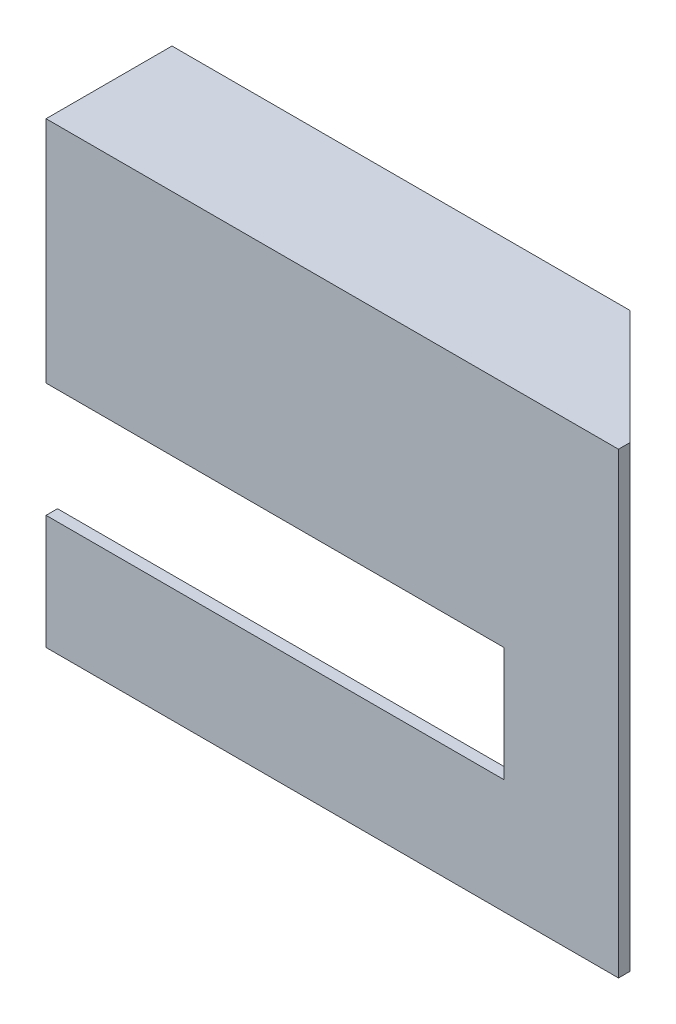
ISO-10303-21;
HEADER;
FILE_DESCRIPTION(('STEP AP214'),'2;1');
FILE_NAME('part.step','',(''),(''),'','','');
FILE_SCHEMA(('AUTOMOTIVE_DESIGN { 1 0 10303 214 1 1 1 1 }'));
ENDSEC;
DATA;
#1=APPLICATION_CONTEXT('core data for automotive mechanical design processes');
#2=APPLICATION_PROTOCOL_DEFINITION('international standard','automotive_design',2000,#1);
#3=PRODUCT_CONTEXT('',#1,'mechanical');
#4=PRODUCT('Part','Part','',(#3));
#5=PRODUCT_RELATED_PRODUCT_CATEGORY('part','',(#4));
#6=PRODUCT_DEFINITION_FORMATION('','',#4);
#7=PRODUCT_DEFINITION_CONTEXT('part definition',#1,'design');
#8=PRODUCT_DEFINITION('design','',#6,#7);
#9=PRODUCT_DEFINITION_SHAPE('','',#8);
#10=(LENGTH_UNIT() NAMED_UNIT(*) SI_UNIT(.MILLI.,.METRE.));
#11=(NAMED_UNIT(*) PLANE_ANGLE_UNIT() SI_UNIT($,.RADIAN.));
#12=(NAMED_UNIT(*) SI_UNIT($,.STERADIAN.) SOLID_ANGLE_UNIT());
#13=UNCERTAINTY_MEASURE_WITH_UNIT(LENGTH_MEASURE(1.E-05),#10,'distance_accuracy_value','');
#14=(GEOMETRIC_REPRESENTATION_CONTEXT(3) GLOBAL_UNCERTAINTY_ASSIGNED_CONTEXT((#13)) GLOBAL_UNIT_ASSIGNED_CONTEXT((#10,
#11,#12)) REPRESENTATION_CONTEXT('',''));
#15=CARTESIAN_POINT('',(0.,0.,0.));
#16=DIRECTION('',(0.,0.,1.));
#17=DIRECTION('',(1.,0.,0.));
#18=AXIS2_PLACEMENT_3D('',#15,#16,#17);
#19=CARTESIAN_POINT('',(0.,0.,0.));
#20=DIRECTION('',(0.,0.,1.));
#21=DIRECTION('',(1.,0.,0.));
#22=AXIS2_PLACEMENT_3D('',#19,#20,#21);
#23=PLANE('',#22);
#24=DIRECTION('',(-1.,0.,0.));
#25=VECTOR('',#24,1.);
#26=CARTESIAN_POINT('',(-20.1129872057257,10.9548051177097,0.));
#27=LINE('',#26,#25);
#28=CARTESIAN_POINT('',(29.8870127942743,10.9548051177097,0.));
#29=VERTEX_POINT('',#28);
#30=CARTESIAN_POINT('',(-20.1129872057257,10.9548051177097,0.));
#31=VERTEX_POINT('',#30);
#32=EDGE_CURVE('E122',#29,#31,#27,.T.);
#33=ORIENTED_EDGE('',*,*,#32,.F.);
#34=DIRECTION('',(0.,1.,0.));
#35=VECTOR('',#34,1.);
#36=CARTESIAN_POINT('',(29.8870127942743,11.9548051177097,0.));
#37=LINE('',#36,#35);
#38=CARTESIAN_POINT('',(29.8870127942743,-28.0451948822903,0.));
#39=VERTEX_POINT('',#38);
#40=EDGE_CURVE('E130',#39,#29,#37,.T.);
#41=ORIENTED_EDGE('',*,*,#40,.F.);
#42=DIRECTION('',(1.,0.,0.));
#43=VECTOR('',#42,1.);
#44=CARTESIAN_POINT('',(-20.1129872057257,-28.0451948822903,0.));
#45=LINE('',#44,#43);
#46=CARTESIAN_POINT('',(-20.1129872057257,-28.0451948822903,0.));
#47=VERTEX_POINT('',#46);
#48=EDGE_CURVE('E230',#47,#39,#45,.T.);
#49=ORIENTED_EDGE('',*,*,#48,.F.);
#50=DIRECTION('',(0.,-1.,0.));
#51=VECTOR('',#50,1.);
#52=CARTESIAN_POINT('',(-20.1129872057257,-18.0451948822903,0.));
#53=LINE('',#52,#51);
#54=CARTESIAN_POINT('',(-20.1129872057257,-18.0451948822903,0.));
#55=VERTEX_POINT('',#54);
#56=EDGE_CURVE('E228',#55,#47,#53,.T.);
#57=ORIENTED_EDGE('',*,*,#56,.F.);
#58=DIRECTION('',(-1.,0.,0.));
#59=VECTOR('',#58,1.);
#60=CARTESIAN_POINT('',(19.8870127942743,-18.0451948822903,0.));
#61=LINE('',#60,#59);
#62=CARTESIAN_POINT('',(19.8870127942743,-18.0451948822903,0.));
#63=VERTEX_POINT('',#62);
#64=EDGE_CURVE('E226',#63,#55,#61,.T.);
#65=ORIENTED_EDGE('',*,*,#64,.F.);
#66=DIRECTION('',(0.,-1.,0.));
#67=VECTOR('',#66,1.);
#68=CARTESIAN_POINT('',(19.8870127942743,-8.04519488229028,0.));
#69=LINE('',#68,#67);
#70=CARTESIAN_POINT('',(19.8870127942743,-8.04519488229028,0.));
#71=VERTEX_POINT('',#70);
#72=EDGE_CURVE('E224',#71,#63,#69,.T.);
#73=ORIENTED_EDGE('',*,*,#72,.F.);
#74=DIRECTION('',(1.,0.,0.));
#75=VECTOR('',#74,1.);
#76=CARTESIAN_POINT('',(-20.1129872057257,-8.04519488229028,0.));
#77=LINE('',#76,#75);
#78=CARTESIAN_POINT('',(-20.1129872057257,-8.04519488229028,0.));
#79=VERTEX_POINT('',#78);
#80=EDGE_CURVE('E222',#79,#71,#77,.T.);
#81=ORIENTED_EDGE('',*,*,#80,.F.);
#82=DIRECTION('',(0.,-1.,0.));
#83=VECTOR('',#82,1.);
#84=CARTESIAN_POINT('',(-20.1129872057257,11.9548051177097,0.));
#85=LINE('',#84,#83);
#86=EDGE_CURVE('E146',#31,#79,#85,.T.);
#87=ORIENTED_EDGE('',*,*,#86,.F.);
#88=EDGE_LOOP('',(#33,#41,#49,#57,#65,#73,#81,#87));
#89=FACE_BOUND('',#88,.T.);
#90=ADVANCED_FACE('F33',(#89),#23,.F.);
#91=CARTESIAN_POINT('',(29.8870127942743,11.9548051177097,1.));
#92=DIRECTION('',(-1.,0.,0.));
#93=DIRECTION('',(0.,-1.,0.));
#94=AXIS2_PLACEMENT_3D('',#91,#92,#93);
#95=PLANE('',#94);
#96=ORIENTED_EDGE('',*,*,#40,.T.);
#97=DIRECTION('',(0.,1.,0.));
#98=VECTOR('',#97,1.);
#99=CARTESIAN_POINT('',(29.8870127942743,11.9548051177097,0.));
#100=LINE('',#99,#98);
#101=CARTESIAN_POINT('',(29.8870127942743,11.9548051177097,0.));
#102=VERTEX_POINT('',#101);
#103=EDGE_CURVE('E41',#29,#102,#100,.T.);
#104=ORIENTED_EDGE('',*,*,#103,.T.);
#105=DIRECTION('',(0.,0.,-1.));
#106=VECTOR('',#105,1.);
#107=CARTESIAN_POINT('',(29.8870127942743,11.9548051177097,1.));
#108=LINE('',#107,#106);
#109=CARTESIAN_POINT('',(29.8870127942743,11.9548051177097,1.));
#110=VERTEX_POINT('',#109);
#111=EDGE_CURVE('E154',#110,#102,#108,.T.);
#112=ORIENTED_EDGE('',*,*,#111,.F.);
#113=DIRECTION('',(0.,1.,0.));
#114=VECTOR('',#113,1.);
#115=CARTESIAN_POINT('',(29.8870127942743,-17.7643136671579,1.));
#116=LINE('',#115,#114);
#117=CARTESIAN_POINT('',(29.8870127942743,-28.0451948822903,1.));
#118=VERTEX_POINT('',#117);
#119=EDGE_CURVE('E142',#118,#110,#116,.T.);
#120=ORIENTED_EDGE('',*,*,#119,.F.);
#121=DIRECTION('',(0.,0.,-1.));
#122=VECTOR('',#121,1.);
#123=CARTESIAN_POINT('',(29.8870127942743,-28.0451948822903,1.));
#124=LINE('',#123,#122);
#125=EDGE_CURVE('E168',#118,#39,#124,.T.);
#126=ORIENTED_EDGE('',*,*,#125,.T.);
#127=EDGE_LOOP('',(#96,#104,#112,#120,#126));
#128=FACE_BOUND('',#127,.T.);
#129=ADVANCED_FACE('F165',(#128),#95,.F.);
#130=CARTESIAN_POINT('',(-20.1129872057257,11.9548051177097,1.));
#131=DIRECTION('',(0.,-1.,0.));
#132=DIRECTION('',(0.,0.,-1.));
#133=AXIS2_PLACEMENT_3D('',#130,#131,#132);
#134=PLANE('',#133);
#135=ORIENTED_EDGE('',*,*,#111,.T.);
#136=DIRECTION('',(0.707106781186546,0.,0.707106781186549));
#137=VECTOR('',#136,1.);
#138=CARTESIAN_POINT('',(19.8870127942743,11.9548051177097,-10.));
#139=LINE('',#138,#137);
#140=CARTESIAN_POINT('',(19.8870127942743,11.9548051177097,-10.));
#141=VERTEX_POINT('',#140);
#142=EDGE_CURVE('E11',#102,#141,#139,.F.);
#143=ORIENTED_EDGE('',*,*,#142,.T.);
#144=DIRECTION('',(1.,0.,0.));
#145=VECTOR('',#144,1.);
#146=CARTESIAN_POINT('',(29.8870127942743,11.9548051177097,-10.));
#147=LINE('',#146,#145);
#148=CARTESIAN_POINT('',(-20.1129872057257,11.9548051177097,-10.));
#149=VERTEX_POINT('',#148);
#150=EDGE_CURVE('E131',#149,#141,#147,.T.);
#151=ORIENTED_EDGE('',*,*,#150,.F.);
#152=DIRECTION('',(0.,0.,-1.));
#153=VECTOR('',#152,1.);
#154=CARTESIAN_POINT('',(-20.1129872057257,11.9548051177097,1.));
#155=LINE('',#154,#153);
#156=CARTESIAN_POINT('',(-20.1129872057257,11.9548051177097,1.));
#157=VERTEX_POINT('',#156);
#158=EDGE_CURVE('E136',#157,#149,#155,.T.);
#159=ORIENTED_EDGE('',*,*,#158,.F.);
#160=DIRECTION('',(-1.,0.,0.));
#161=VECTOR('',#160,1.);
#162=CARTESIAN_POINT('',(-20.1129872057257,11.9548051177097,1.));
#163=LINE('',#162,#161);
#164=EDGE_CURVE('E210',#110,#157,#163,.T.);
#165=ORIENTED_EDGE('',*,*,#164,.F.);
#166=EDGE_LOOP('',(#135,#143,#151,#159,#165));
#167=FACE_BOUND('',#166,.T.);
#168=ADVANCED_FACE('F179',(#167),#134,.F.);
#169=CARTESIAN_POINT('',(-20.1129872057257,11.9548051177097,1.));
#170=DIRECTION('',(1.,0.,0.));
#171=DIRECTION('',(0.,0.,-1.));
#172=AXIS2_PLACEMENT_3D('',#169,#170,#171);
#173=PLANE('',#172);
#174=ORIENTED_EDGE('',*,*,#158,.T.);
#175=DIRECTION('',(0.,1.,0.));
#176=VECTOR('',#175,1.);
#177=CARTESIAN_POINT('',(-20.1129872057257,11.9548051177097,-10.));
#178=LINE('',#177,#176);
#179=CARTESIAN_POINT('',(-20.1129872057257,10.9548051177097,-10.));
#180=VERTEX_POINT('',#179);
#181=EDGE_CURVE('E118',#180,#149,#178,.T.);
#182=ORIENTED_EDGE('',*,*,#181,.F.);
#183=DIRECTION('',(0.,0.,1.));
#184=VECTOR('',#183,1.);
#185=CARTESIAN_POINT('',(-20.1129872057257,10.9548051177097,-10.));
#186=LINE('',#185,#184);
#187=EDGE_CURVE('E126',#180,#31,#186,.T.);
#188=ORIENTED_EDGE('',*,*,#187,.T.);
#189=ORIENTED_EDGE('',*,*,#86,.T.);
#190=DIRECTION('',(0.,0.,-1.));
#191=VECTOR('',#190,1.);
#192=CARTESIAN_POINT('',(-20.1129872057257,-8.04519488229028,1.));
#193=LINE('',#192,#191);
#194=CARTESIAN_POINT('',(-20.1129872057257,-8.04519488229028,1.));
#195=VERTEX_POINT('',#194);
#196=EDGE_CURVE('E212',#195,#79,#193,.T.);
#197=ORIENTED_EDGE('',*,*,#196,.F.);
#198=DIRECTION('',(0.,-1.,0.));
#199=VECTOR('',#198,1.);
#200=CARTESIAN_POINT('',(-20.1129872057257,11.9548051177097,1.));
#201=LINE('',#200,#199);
#202=EDGE_CURVE('E265',#157,#195,#201,.T.);
#203=ORIENTED_EDGE('',*,*,#202,.F.);
#204=EDGE_LOOP('',(#174,#182,#188,#189,#197,#203));
#205=FACE_BOUND('',#204,.T.);
#206=ADVANCED_FACE('F133',(#205),#173,.F.);
#207=CARTESIAN_POINT('',(-20.1129872057257,-8.04519488229028,1.));
#208=DIRECTION('',(0.,1.,0.));
#209=DIRECTION('',(0.,0.,1.));
#210=AXIS2_PLACEMENT_3D('',#207,#208,#209);
#211=PLANE('',#210);
#212=ORIENTED_EDGE('',*,*,#80,.T.);
#213=DIRECTION('',(0.,0.,-1.));
#214=VECTOR('',#213,1.);
#215=CARTESIAN_POINT('',(19.8870127942743,-8.04519488229028,1.));
#216=LINE('',#215,#214);
#217=CARTESIAN_POINT('',(19.8870127942743,-8.04519488229028,1.));
#218=VERTEX_POINT('',#217);
#219=EDGE_CURVE('E242',#218,#71,#216,.T.);
#220=ORIENTED_EDGE('',*,*,#219,.F.);
#221=DIRECTION('',(1.,0.,0.));
#222=VECTOR('',#221,1.);
#223=CARTESIAN_POINT('',(-20.1129872057257,-8.04519488229028,1.));
#224=LINE('',#223,#222);
#225=EDGE_CURVE('E248',#195,#218,#224,.T.);
#226=ORIENTED_EDGE('',*,*,#225,.F.);
#227=ORIENTED_EDGE('',*,*,#196,.T.);
#228=EDGE_LOOP('',(#212,#220,#226,#227));
#229=FACE_BOUND('',#228,.T.);
#230=ADVANCED_FACE('F199',(#229),#211,.F.);
#231=CARTESIAN_POINT('',(19.8870127942743,-8.04519488229028,1.));
#232=DIRECTION('',(1.,0.,0.));
#233=DIRECTION('',(0.,0.,-1.));
#234=AXIS2_PLACEMENT_3D('',#231,#232,#233);
#235=PLANE('',#234);
#236=ORIENTED_EDGE('',*,*,#72,.T.);
#237=DIRECTION('',(0.,0.,-1.));
#238=VECTOR('',#237,1.);
#239=CARTESIAN_POINT('',(19.8870127942743,-18.0451948822903,1.));
#240=LINE('',#239,#238);
#241=CARTESIAN_POINT('',(19.8870127942743,-18.0451948822903,1.));
#242=VERTEX_POINT('',#241);
#243=EDGE_CURVE('E239',#242,#63,#240,.T.);
#244=ORIENTED_EDGE('',*,*,#243,.F.);
#245=DIRECTION('',(0.,-1.,0.));
#246=VECTOR('',#245,1.);
#247=CARTESIAN_POINT('',(19.8870127942743,-8.04519488229028,1.));
#248=LINE('',#247,#246);
#249=EDGE_CURVE('E260',#218,#242,#248,.T.);
#250=ORIENTED_EDGE('',*,*,#249,.F.);
#251=ORIENTED_EDGE('',*,*,#219,.T.);
#252=EDGE_LOOP('',(#236,#244,#250,#251));
#253=FACE_BOUND('',#252,.T.);
#254=ADVANCED_FACE('F195',(#253),#235,.F.);
#255=CARTESIAN_POINT('',(19.8870127942743,-18.0451948822903,1.));
#256=DIRECTION('',(0.,-1.,0.));
#257=DIRECTION('',(1.,0.,0.));
#258=AXIS2_PLACEMENT_3D('',#255,#256,#257);
#259=PLANE('',#258);
#260=ORIENTED_EDGE('',*,*,#64,.T.);
#261=DIRECTION('',(0.,0.,-1.));
#262=VECTOR('',#261,1.);
#263=CARTESIAN_POINT('',(-20.1129872057257,-18.0451948822903,1.));
#264=LINE('',#263,#262);
#265=CARTESIAN_POINT('',(-20.1129872057257,-18.0451948822903,1.));
#266=VERTEX_POINT('',#265);
#267=EDGE_CURVE('E236',#266,#55,#264,.T.);
#268=ORIENTED_EDGE('',*,*,#267,.F.);
#269=DIRECTION('',(-1.,0.,0.));
#270=VECTOR('',#269,1.);
#271=CARTESIAN_POINT('',(19.8870127942743,-18.0451948822903,1.));
#272=LINE('',#271,#270);
#273=EDGE_CURVE('E256',#242,#266,#272,.T.);
#274=ORIENTED_EDGE('',*,*,#273,.F.);
#275=ORIENTED_EDGE('',*,*,#243,.T.);
#276=EDGE_LOOP('',(#260,#268,#274,#275));
#277=FACE_BOUND('',#276,.T.);
#278=ADVANCED_FACE('F191',(#277),#259,.F.);
#279=CARTESIAN_POINT('',(-20.1129872057257,-18.0451948822903,1.));
#280=DIRECTION('',(1.,0.,0.));
#281=DIRECTION('',(0.,0.,-1.));
#282=AXIS2_PLACEMENT_3D('',#279,#280,#281);
#283=PLANE('',#282);
#284=ORIENTED_EDGE('',*,*,#56,.T.);
#285=DIRECTION('',(0.,0.,-1.));
#286=VECTOR('',#285,1.);
#287=CARTESIAN_POINT('',(-20.1129872057257,-28.0451948822903,1.));
#288=LINE('',#287,#286);
#289=CARTESIAN_POINT('',(-20.1129872057257,-28.0451948822903,1.));
#290=VERTEX_POINT('',#289);
#291=EDGE_CURVE('E233',#290,#47,#288,.T.);
#292=ORIENTED_EDGE('',*,*,#291,.F.);
#293=DIRECTION('',(0.,-1.,0.));
#294=VECTOR('',#293,1.);
#295=CARTESIAN_POINT('',(-20.1129872057257,-18.0451948822903,1.));
#296=LINE('',#295,#294);
#297=EDGE_CURVE('E259',#266,#290,#296,.T.);
#298=ORIENTED_EDGE('',*,*,#297,.F.);
#299=ORIENTED_EDGE('',*,*,#267,.T.);
#300=EDGE_LOOP('',(#284,#292,#298,#299));
#301=FACE_BOUND('',#300,.T.);
#302=ADVANCED_FACE('F187',(#301),#283,.F.);
#303=CARTESIAN_POINT('',(-20.1129872057257,-28.0451948822903,1.));
#304=DIRECTION('',(0.,1.,0.));
#305=DIRECTION('',(0.,0.,1.));
#306=AXIS2_PLACEMENT_3D('',#303,#304,#305);
#307=PLANE('',#306);
#308=ORIENTED_EDGE('',*,*,#48,.T.);
#309=ORIENTED_EDGE('',*,*,#125,.F.);
#310=DIRECTION('',(1.,0.,0.));
#311=VECTOR('',#310,1.);
#312=CARTESIAN_POINT('',(-20.1129872057257,-28.0451948822903,1.));
#313=LINE('',#312,#311);
#314=EDGE_CURVE('E218',#290,#118,#313,.T.);
#315=ORIENTED_EDGE('',*,*,#314,.F.);
#316=ORIENTED_EDGE('',*,*,#291,.T.);
#317=EDGE_LOOP('',(#308,#309,#315,#316));
#318=FACE_BOUND('',#317,.T.);
#319=ADVANCED_FACE('F184',(#318),#307,.F.);
#320=CARTESIAN_POINT('',(0.,0.,1.));
#321=DIRECTION('',(0.,0.,1.));
#322=DIRECTION('',(1.,0.,0.));
#323=AXIS2_PLACEMENT_3D('',#320,#321,#322);
#324=PLANE('',#323);
#325=ORIENTED_EDGE('',*,*,#119,.T.);
#326=ORIENTED_EDGE('',*,*,#164,.T.);
#327=ORIENTED_EDGE('',*,*,#202,.T.);
#328=ORIENTED_EDGE('',*,*,#225,.T.);
#329=ORIENTED_EDGE('',*,*,#249,.T.);
#330=ORIENTED_EDGE('',*,*,#273,.T.);
#331=ORIENTED_EDGE('',*,*,#297,.T.);
#332=ORIENTED_EDGE('',*,*,#314,.T.);
#333=EDGE_LOOP('',(#325,#326,#327,#328,#329,#330,#331,#332));
#334=FACE_BOUND('',#333,.T.);
#335=ADVANCED_FACE('F182',(#334),#324,.T.);
#336=CARTESIAN_POINT('',(-20.1129872057257,10.9548051177097,-10.));
#337=DIRECTION('',(0.,1.,0.));
#338=DIRECTION('',(-1.,0.,0.));
#339=AXIS2_PLACEMENT_3D('',#336,#337,#338);
#340=PLANE('',#339);
#341=DIRECTION('',(-1.,0.,0.));
#342=VECTOR('',#341,1.);
#343=CARTESIAN_POINT('',(-20.1129872057257,10.9548051177097,-10.));
#344=LINE('',#343,#342);
#345=CARTESIAN_POINT('',(19.8870127942743,10.9548051177097,-10.));
#346=VERTEX_POINT('',#345);
#347=EDGE_CURVE('E114',#346,#180,#344,.T.);
#348=ORIENTED_EDGE('',*,*,#347,.F.);
#349=DIRECTION('',(-0.707106781186546,0.,-0.707106781186549));
#350=VECTOR('',#349,1.);
#351=CARTESIAN_POINT('',(19.8870127942743,10.9548051177097,-10.));
#352=LINE('',#351,#350);
#353=EDGE_CURVE('E153',#346,#29,#352,.F.);
#354=ORIENTED_EDGE('',*,*,#353,.T.);
#355=ORIENTED_EDGE('',*,*,#32,.T.);
#356=ORIENTED_EDGE('',*,*,#187,.F.);
#357=EDGE_LOOP('',(#348,#354,#355,#356));
#358=FACE_BOUND('',#357,.T.);
#359=ADVANCED_FACE('F127',(#358),#340,.F.);
#360=CARTESIAN_POINT('',(0.,0.,-10.));
#361=DIRECTION('',(0.,0.,1.));
#362=DIRECTION('',(1.,0.,0.));
#363=AXIS2_PLACEMENT_3D('',#360,#361,#362);
#364=PLANE('',#363);
#365=ORIENTED_EDGE('',*,*,#150,.T.);
#366=DIRECTION('',(0.,-1.,0.));
#367=VECTOR('',#366,1.);
#368=CARTESIAN_POINT('',(19.8870127942743,0.,-10.));
#369=LINE('',#368,#367);
#370=EDGE_CURVE('E120',#141,#346,#369,.T.);
#371=ORIENTED_EDGE('',*,*,#370,.T.);
#372=ORIENTED_EDGE('',*,*,#347,.T.);
#373=ORIENTED_EDGE('',*,*,#181,.T.);
#374=EDGE_LOOP('',(#365,#371,#372,#373));
#375=FACE_BOUND('',#374,.T.);
#376=ADVANCED_FACE('F116',(#375),#364,.F.);
#377=CARTESIAN_POINT('',(19.8870127942743,0.,-10.));
#378=DIRECTION('',(-0.707106781186549,0.,0.707106781186546));
#379=DIRECTION('',(0.,-1.,0.));
#380=AXIS2_PLACEMENT_3D('',#377,#378,#379);
#381=PLANE('',#380);
#382=ORIENTED_EDGE('',*,*,#142,.F.);
#383=ORIENTED_EDGE('',*,*,#103,.F.);
#384=ORIENTED_EDGE('',*,*,#353,.F.);
#385=ORIENTED_EDGE('',*,*,#370,.F.);
#386=EDGE_LOOP('',(#382,#383,#384,#385));
#387=FACE_BOUND('',#386,.T.);
#388=ADVANCED_FACE('F35',(#387),#381,.F.);
#389=CLOSED_SHELL('',(#90,#129,#168,#206,#230,#254,#278,#302,#319,#335,#359,#376,#388));
#390=MANIFOLD_SOLID_BREP('B2',#389);
#391=ADVANCED_BREP_SHAPE_REPRESENTATION('',(#18,#390),#14);
#392=SHAPE_DEFINITION_REPRESENTATION(#9,#391);
ENDSEC;
END-ISO-10303-21;
